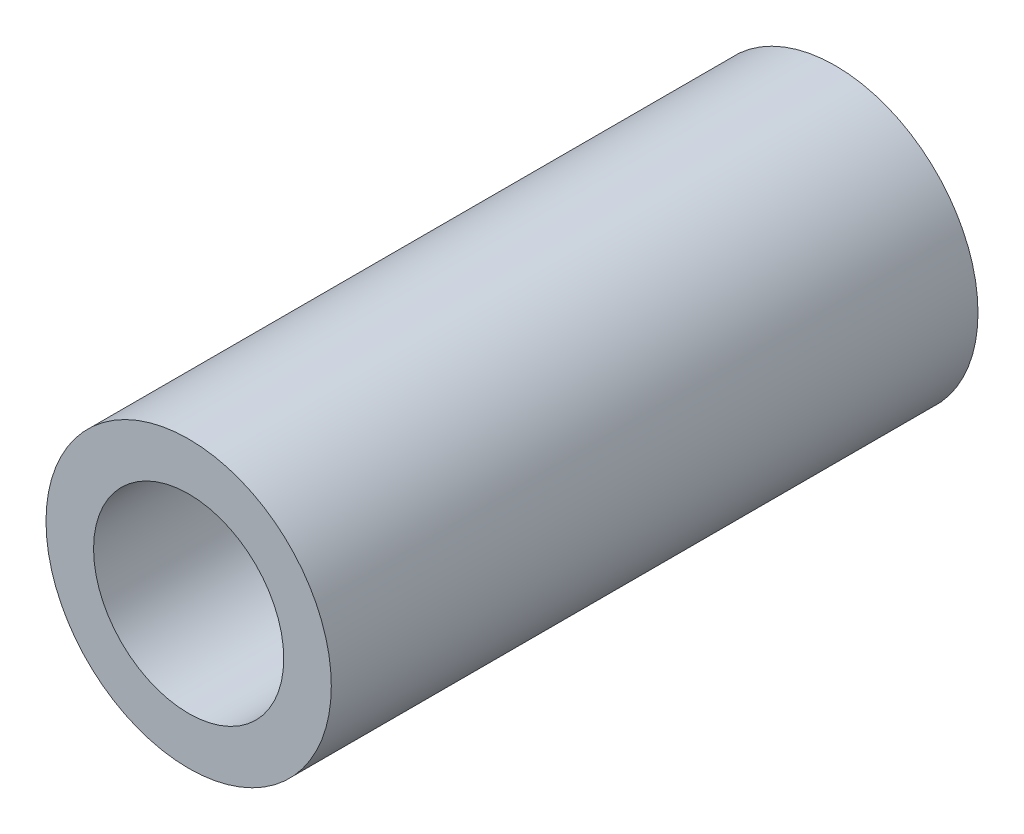
ISO-10303-21;
HEADER;
FILE_DESCRIPTION(('STEP AP214'),'2;1');
FILE_NAME('part.step','',(''),(''),'','','');
FILE_SCHEMA(('AUTOMOTIVE_DESIGN { 1 0 10303 214 1 1 1 1 }'));
ENDSEC;
DATA;
#1=APPLICATION_CONTEXT('core data for automotive mechanical design processes');
#2=APPLICATION_PROTOCOL_DEFINITION('international standard','automotive_design',2000,#1);
#3=PRODUCT_CONTEXT('',#1,'mechanical');
#4=PRODUCT('Part','Part','',(#3));
#5=PRODUCT_RELATED_PRODUCT_CATEGORY('part','',(#4));
#6=PRODUCT_DEFINITION_FORMATION('','',#4);
#7=PRODUCT_DEFINITION_CONTEXT('part definition',#1,'design');
#8=PRODUCT_DEFINITION('design','',#6,#7);
#9=PRODUCT_DEFINITION_SHAPE('','',#8);
#10=(LENGTH_UNIT() NAMED_UNIT(*) SI_UNIT(.MILLI.,.METRE.));
#11=(NAMED_UNIT(*) PLANE_ANGLE_UNIT() SI_UNIT($,.RADIAN.));
#12=(NAMED_UNIT(*) SI_UNIT($,.STERADIAN.) SOLID_ANGLE_UNIT());
#13=UNCERTAINTY_MEASURE_WITH_UNIT(LENGTH_MEASURE(1.E-05),#10,'distance_accuracy_value','');
#14=(GEOMETRIC_REPRESENTATION_CONTEXT(3) GLOBAL_UNCERTAINTY_ASSIGNED_CONTEXT((#13)) GLOBAL_UNIT_ASSIGNED_CONTEXT((#10,
#11,#12)) REPRESENTATION_CONTEXT('',''));
#15=CARTESIAN_POINT('',(0.,0.,0.));
#16=DIRECTION('',(0.,0.,1.));
#17=DIRECTION('',(1.,0.,0.));
#18=AXIS2_PLACEMENT_3D('',#15,#16,#17);
#19=CARTESIAN_POINT('',(0.,0.,3.4));
#20=DIRECTION('',(0.,0.,1.));
#21=DIRECTION('',(1.,0.,0.));
#22=AXIS2_PLACEMENT_3D('',#19,#20,#21);
#23=PLANE('',#22);
#24=CARTESIAN_POINT('',(0.,0.,3.4));
#25=DIRECTION('',(0.,0.,1.));
#26=DIRECTION('',(1.,0.,0.));
#27=AXIS2_PLACEMENT_3D('',#24,#25,#26);
#28=CIRCLE('',#27,1.5);
#29=CARTESIAN_POINT('',(1.5,0.,3.4));
#30=VERTEX_POINT('',#29);
#31=EDGE_CURVE('E10',#30,#30,#28,.T.);
#32=ORIENTED_EDGE('',*,*,#31,.T.);
#33=EDGE_LOOP('',(#32));
#34=FACE_BOUND('',#33,.T.);
#35=CARTESIAN_POINT('',(0.,0.,3.4));
#36=DIRECTION('',(0.,0.,1.));
#37=DIRECTION('',(1.,0.,0.));
#38=AXIS2_PLACEMENT_3D('',#35,#36,#37);
#39=CIRCLE('',#38,1.);
#40=CARTESIAN_POINT('',(1.,0.,3.4));
#41=VERTEX_POINT('',#40);
#42=EDGE_CURVE('E52',#41,#41,#39,.T.);
#43=ORIENTED_EDGE('',*,*,#42,.F.);
#44=EDGE_LOOP('',(#43));
#45=FACE_BOUND('',#44,.T.);
#46=ADVANCED_FACE('F39',(#34,#45),#23,.T.);
#47=CARTESIAN_POINT('',(0.,0.,-3.4));
#48=DIRECTION('',(0.,0.,1.));
#49=DIRECTION('',(1.,0.,0.));
#50=AXIS2_PLACEMENT_3D('',#47,#48,#49);
#51=PLANE('',#50);
#52=CARTESIAN_POINT('',(0.,0.,-3.4));
#53=DIRECTION('',(0.,0.,1.));
#54=DIRECTION('',(1.,0.,0.));
#55=AXIS2_PLACEMENT_3D('',#52,#53,#54);
#56=CIRCLE('',#55,1.5);
#57=CARTESIAN_POINT('',(1.5,0.,-3.4));
#58=VERTEX_POINT('',#57);
#59=EDGE_CURVE('E43',#58,#58,#56,.T.);
#60=ORIENTED_EDGE('',*,*,#59,.F.);
#61=EDGE_LOOP('',(#60));
#62=FACE_BOUND('',#61,.T.);
#63=CARTESIAN_POINT('',(0.,0.,-3.4));
#64=DIRECTION('',(0.,0.,1.));
#65=DIRECTION('',(1.,0.,0.));
#66=AXIS2_PLACEMENT_3D('',#63,#64,#65);
#67=CIRCLE('',#66,1.);
#68=CARTESIAN_POINT('',(1.,0.,-3.4));
#69=VERTEX_POINT('',#68);
#70=EDGE_CURVE('E54',#69,#69,#67,.T.);
#71=ORIENTED_EDGE('',*,*,#70,.T.);
#72=EDGE_LOOP('',(#71));
#73=FACE_BOUND('',#72,.T.);
#74=ADVANCED_FACE('F66',(#62,#73),#51,.F.);
#75=CARTESIAN_POINT('',(0.,0.,3.4));
#76=DIRECTION('',(0.,0.,-1.));
#77=DIRECTION('',(-1.,0.,0.));
#78=AXIS2_PLACEMENT_3D('',#75,#76,#77);
#79=CYLINDRICAL_SURFACE('',#78,1.5);
#80=ORIENTED_EDGE('',*,*,#31,.F.);
#81=EDGE_LOOP('',(#80));
#82=FACE_BOUND('',#81,.T.);
#83=ORIENTED_EDGE('',*,*,#59,.T.);
#84=EDGE_LOOP('',(#83));
#85=FACE_BOUND('',#84,.T.);
#86=ADVANCED_FACE('F41',(#82,#85),#79,.T.);
#87=CARTESIAN_POINT('',(0.,0.,3.4));
#88=DIRECTION('',(0.,0.,-1.));
#89=DIRECTION('',(-1.,0.,0.));
#90=AXIS2_PLACEMENT_3D('',#87,#88,#89);
#91=CYLINDRICAL_SURFACE('',#90,1.);
#92=ORIENTED_EDGE('',*,*,#42,.T.);
#93=EDGE_LOOP('',(#92));
#94=FACE_BOUND('',#93,.T.);
#95=ORIENTED_EDGE('',*,*,#70,.F.);
#96=EDGE_LOOP('',(#95));
#97=FACE_BOUND('',#96,.T.);
#98=ADVANCED_FACE('F62',(#94,#97),#91,.F.);
#99=CLOSED_SHELL('',(#46,#74,#86,#98));
#100=MANIFOLD_SOLID_BREP('B2',#99);
#101=ADVANCED_BREP_SHAPE_REPRESENTATION('',(#18,#100),#14);
#102=SHAPE_DEFINITION_REPRESENTATION(#9,#101);
ENDSEC;
END-ISO-10303-21;
